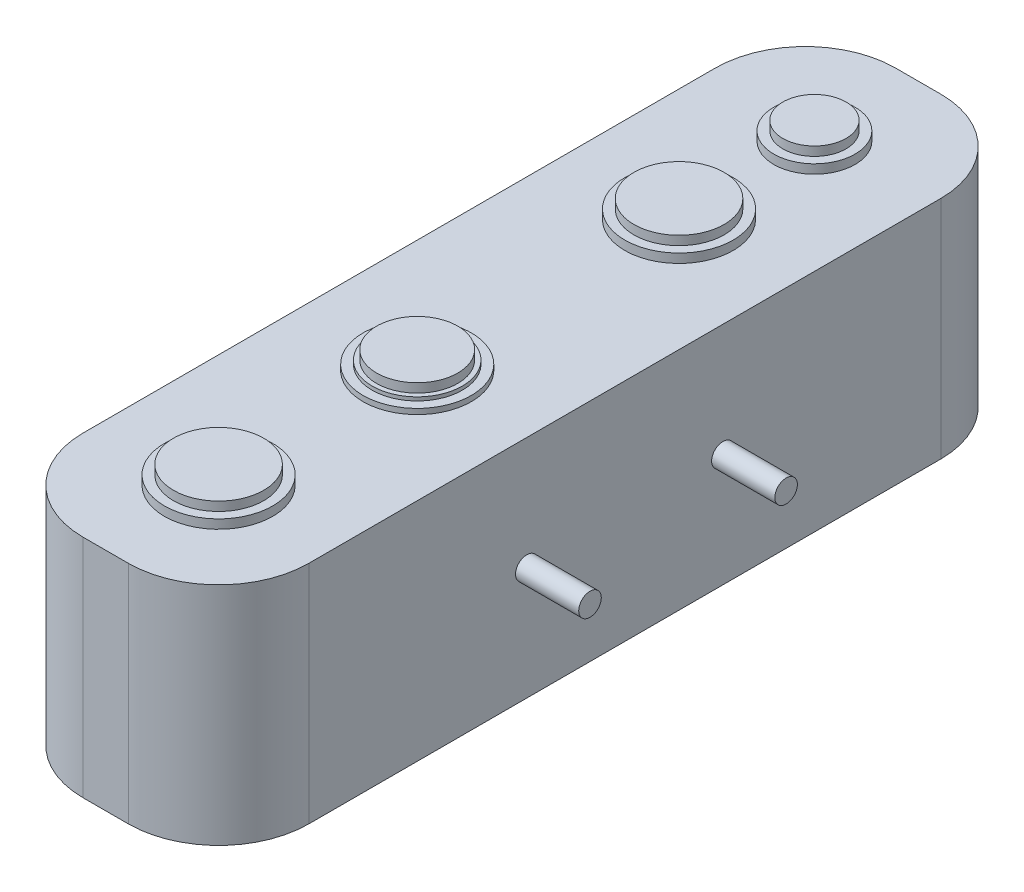
ISO-10303-21;
HEADER;
FILE_DESCRIPTION(('STEP AP214'),'2;1');
FILE_NAME('part.step','',(''),(''),'','','');
FILE_SCHEMA(('AUTOMOTIVE_DESIGN { 1 0 10303 214 1 1 1 1 }'));
ENDSEC;
DATA;
#1=APPLICATION_CONTEXT('core data for automotive mechanical design processes');
#2=APPLICATION_PROTOCOL_DEFINITION('international standard','automotive_design',2000,#1);
#3=PRODUCT_CONTEXT('',#1,'mechanical');
#4=PRODUCT('Part','Part','',(#3));
#5=PRODUCT_RELATED_PRODUCT_CATEGORY('part','',(#4));
#6=PRODUCT_DEFINITION_FORMATION('','',#4);
#7=PRODUCT_DEFINITION_CONTEXT('part definition',#1,'design');
#8=PRODUCT_DEFINITION('design','',#6,#7);
#9=PRODUCT_DEFINITION_SHAPE('','',#8);
#10=(LENGTH_UNIT() NAMED_UNIT(*) SI_UNIT(.MILLI.,.METRE.));
#11=(NAMED_UNIT(*) PLANE_ANGLE_UNIT() SI_UNIT($,.RADIAN.));
#12=(NAMED_UNIT(*) SI_UNIT($,.STERADIAN.) SOLID_ANGLE_UNIT());
#13=UNCERTAINTY_MEASURE_WITH_UNIT(LENGTH_MEASURE(1.E-05),#10,'distance_accuracy_value','');
#14=(GEOMETRIC_REPRESENTATION_CONTEXT(3) GLOBAL_UNCERTAINTY_ASSIGNED_CONTEXT((#13)) GLOBAL_UNIT_ASSIGNED_CONTEXT((#10,
#11,#12)) REPRESENTATION_CONTEXT('',''));
#15=CARTESIAN_POINT('',(0.,0.,0.));
#16=DIRECTION('',(0.,0.,1.));
#17=DIRECTION('',(1.,0.,0.));
#18=AXIS2_PLACEMENT_3D('',#15,#16,#17);
#19=CARTESIAN_POINT('',(12.5,25.,-45.));
#20=DIRECTION('',(-1.,0.,0.));
#21=DIRECTION('',(0.,0.,1.));
#22=AXIS2_PLACEMENT_3D('',#19,#20,#21);
#23=PLANE('',#22);
#24=CARTESIAN_POINT('',(12.5,12.5,10.86));
#25=DIRECTION('',(-1.,0.,0.));
#26=DIRECTION('',(0.,0.,1.));
#27=AXIS2_PLACEMENT_3D('',#24,#25,#26);
#28=CIRCLE('',#27,1.25);
#29=CARTESIAN_POINT('',(12.5,12.5,12.11));
#30=VERTEX_POINT('',#29);
#31=EDGE_CURVE('E11',#30,#30,#28,.F.);
#32=ORIENTED_EDGE('',*,*,#31,.F.);
#33=EDGE_LOOP('',(#32));
#34=FACE_BOUND('',#33,.T.);
#35=CARTESIAN_POINT('',(12.5,12.5,-10.86));
#36=DIRECTION('',(-1.,0.,0.));
#37=DIRECTION('',(0.,0.,1.));
#38=AXIS2_PLACEMENT_3D('',#35,#36,#37);
#39=CIRCLE('',#38,1.25);
#40=CARTESIAN_POINT('',(12.5,12.5,-9.61000000000002));
#41=VERTEX_POINT('',#40);
#42=EDGE_CURVE('E50',#41,#41,#39,.F.);
#43=ORIENTED_EDGE('',*,*,#42,.F.);
#44=EDGE_LOOP('',(#43));
#45=FACE_BOUND('',#44,.T.);
#46=DIRECTION('',(0.,0.,-1.));
#47=VECTOR('',#46,1.);
#48=CARTESIAN_POINT('',(12.5,25.,-45.));
#49=LINE('',#48,#47);
#50=CARTESIAN_POINT('',(12.5,25.,35.));
#51=VERTEX_POINT('',#50);
#52=CARTESIAN_POINT('',(12.5,25.,-35.));
#53=VERTEX_POINT('',#52);
#54=EDGE_CURVE('E138',#51,#53,#49,.T.);
#55=ORIENTED_EDGE('',*,*,#54,.F.);
#56=DIRECTION('',(0.,-1.,0.));
#57=VECTOR('',#56,1.);
#58=CARTESIAN_POINT('',(12.5,25.,35.));
#59=LINE('',#58,#57);
#60=CARTESIAN_POINT('',(12.5,0.,35.));
#61=VERTEX_POINT('',#60);
#62=EDGE_CURVE('E206',#51,#61,#59,.T.);
#63=ORIENTED_EDGE('',*,*,#62,.T.);
#64=DIRECTION('',(0.,0.,-1.));
#65=VECTOR('',#64,1.);
#66=CARTESIAN_POINT('',(12.5,0.,-45.));
#67=LINE('',#66,#65);
#68=CARTESIAN_POINT('',(12.5,0.,-35.));
#69=VERTEX_POINT('',#68);
#70=EDGE_CURVE('E242',#61,#69,#67,.T.);
#71=ORIENTED_EDGE('',*,*,#70,.T.);
#72=DIRECTION('',(0.,-1.,0.));
#73=VECTOR('',#72,1.);
#74=CARTESIAN_POINT('',(12.5,25.,-35.));
#75=LINE('',#74,#73);
#76=EDGE_CURVE('E203',#69,#53,#75,.F.);
#77=ORIENTED_EDGE('',*,*,#76,.T.);
#78=EDGE_LOOP('',(#55,#63,#71,#77));
#79=FACE_BOUND('',#78,.T.);
#80=ADVANCED_FACE('F41',(#34,#45,#79),#23,.F.);
#81=CARTESIAN_POINT('',(-12.5,25.,-45.));
#82=DIRECTION('',(0.,0.,1.));
#83=DIRECTION('',(1.,0.,0.));
#84=AXIS2_PLACEMENT_3D('',#81,#82,#83);
#85=PLANE('',#84);
#86=DIRECTION('',(-1.,0.,0.));
#87=VECTOR('',#86,1.);
#88=CARTESIAN_POINT('',(-12.5,25.,-45.));
#89=LINE('',#88,#87);
#90=CARTESIAN_POINT('',(2.5,25.,-45.));
#91=VERTEX_POINT('',#90);
#92=CARTESIAN_POINT('',(-2.5,25.,-45.));
#93=VERTEX_POINT('',#92);
#94=EDGE_CURVE('E143',#91,#93,#89,.T.);
#95=ORIENTED_EDGE('',*,*,#94,.F.);
#96=DIRECTION('',(0.,-1.,0.));
#97=VECTOR('',#96,1.);
#98=CARTESIAN_POINT('',(2.5,25.,-45.));
#99=LINE('',#98,#97);
#100=CARTESIAN_POINT('',(2.5,0.,-45.));
#101=VERTEX_POINT('',#100);
#102=EDGE_CURVE('E212',#91,#101,#99,.T.);
#103=ORIENTED_EDGE('',*,*,#102,.T.);
#104=DIRECTION('',(-1.,0.,0.));
#105=VECTOR('',#104,1.);
#106=CARTESIAN_POINT('',(-12.5,0.,-45.));
#107=LINE('',#106,#105);
#108=CARTESIAN_POINT('',(-2.5,0.,-45.));
#109=VERTEX_POINT('',#108);
#110=EDGE_CURVE('E145',#101,#109,#107,.T.);
#111=ORIENTED_EDGE('',*,*,#110,.T.);
#112=DIRECTION('',(0.,-1.,0.));
#113=VECTOR('',#112,1.);
#114=CARTESIAN_POINT('',(-2.5,25.,-45.));
#115=LINE('',#114,#113);
#116=EDGE_CURVE('E57',#109,#93,#115,.F.);
#117=ORIENTED_EDGE('',*,*,#116,.T.);
#118=EDGE_LOOP('',(#95,#103,#111,#117));
#119=FACE_BOUND('',#118,.T.);
#120=ADVANCED_FACE('F223',(#119),#85,.F.);
#121=CARTESIAN_POINT('',(-12.5,25.,-45.));
#122=DIRECTION('',(1.,0.,0.));
#123=DIRECTION('',(0.,0.,-1.));
#124=AXIS2_PLACEMENT_3D('',#121,#122,#123);
#125=PLANE('',#124);
#126=DIRECTION('',(0.,0.,1.));
#127=VECTOR('',#126,1.);
#128=CARTESIAN_POINT('',(-12.5,0.,-45.));
#129=LINE('',#128,#127);
#130=CARTESIAN_POINT('',(-12.5,0.,-35.));
#131=VERTEX_POINT('',#130);
#132=CARTESIAN_POINT('',(-12.5,0.,35.));
#133=VERTEX_POINT('',#132);
#134=EDGE_CURVE('E139',#131,#133,#129,.T.);
#135=ORIENTED_EDGE('',*,*,#134,.T.);
#136=DIRECTION('',(0.,-1.,0.));
#137=VECTOR('',#136,1.);
#138=CARTESIAN_POINT('',(-12.5,25.,35.));
#139=LINE('',#138,#137);
#140=CARTESIAN_POINT('',(-12.5,25.,35.));
#141=VERTEX_POINT('',#140);
#142=EDGE_CURVE('E114',#133,#141,#139,.F.);
#143=ORIENTED_EDGE('',*,*,#142,.T.);
#144=DIRECTION('',(0.,0.,1.));
#145=VECTOR('',#144,1.);
#146=CARTESIAN_POINT('',(-12.5,25.,-45.));
#147=LINE('',#146,#145);
#148=CARTESIAN_POINT('',(-12.5,25.,-35.));
#149=VERTEX_POINT('',#148);
#150=EDGE_CURVE('E236',#149,#141,#147,.T.);
#151=ORIENTED_EDGE('',*,*,#150,.F.);
#152=DIRECTION('',(0.,-1.,0.));
#153=VECTOR('',#152,1.);
#154=CARTESIAN_POINT('',(-12.5,25.,-35.));
#155=LINE('',#154,#153);
#156=EDGE_CURVE('E120',#149,#131,#155,.T.);
#157=ORIENTED_EDGE('',*,*,#156,.T.);
#158=EDGE_LOOP('',(#135,#143,#151,#157));
#159=FACE_BOUND('',#158,.T.);
#160=ADVANCED_FACE('F253',(#159),#125,.F.);
#161=CARTESIAN_POINT('',(-12.5,25.,45.));
#162=DIRECTION('',(0.,0.,-1.));
#163=DIRECTION('',(-1.,0.,0.));
#164=AXIS2_PLACEMENT_3D('',#161,#162,#163);
#165=PLANE('',#164);
#166=DIRECTION('',(1.,0.,0.));
#167=VECTOR('',#166,1.);
#168=CARTESIAN_POINT('',(-12.5,25.,45.));
#169=LINE('',#168,#167);
#170=CARTESIAN_POINT('',(-2.49999999999999,25.,45.));
#171=VERTEX_POINT('',#170);
#172=CARTESIAN_POINT('',(2.5,25.,45.));
#173=VERTEX_POINT('',#172);
#174=EDGE_CURVE('E130',#171,#173,#169,.T.);
#175=ORIENTED_EDGE('',*,*,#174,.F.);
#176=DIRECTION('',(0.,-1.,0.));
#177=VECTOR('',#176,1.);
#178=CARTESIAN_POINT('',(-2.49999999999999,25.,45.));
#179=LINE('',#178,#177);
#180=CARTESIAN_POINT('',(-2.49999999999999,0.,45.));
#181=VERTEX_POINT('',#180);
#182=EDGE_CURVE('E113',#171,#181,#179,.T.);
#183=ORIENTED_EDGE('',*,*,#182,.T.);
#184=DIRECTION('',(1.,0.,0.));
#185=VECTOR('',#184,1.);
#186=CARTESIAN_POINT('',(-12.5,0.,45.));
#187=LINE('',#186,#185);
#188=CARTESIAN_POINT('',(2.5,0.,45.));
#189=VERTEX_POINT('',#188);
#190=EDGE_CURVE('E127',#181,#189,#187,.T.);
#191=ORIENTED_EDGE('',*,*,#190,.T.);
#192=DIRECTION('',(0.,-1.,0.));
#193=VECTOR('',#192,1.);
#194=CARTESIAN_POINT('',(2.5,25.,45.));
#195=LINE('',#194,#193);
#196=EDGE_CURVE('E133',#189,#173,#195,.F.);
#197=ORIENTED_EDGE('',*,*,#196,.T.);
#198=EDGE_LOOP('',(#175,#183,#191,#197));
#199=FACE_BOUND('',#198,.T.);
#200=ADVANCED_FACE('F126',(#199),#165,.F.);
#201=CARTESIAN_POINT('',(0.,25.,0.));
#202=DIRECTION('',(0.,1.,0.));
#203=DIRECTION('',(0.,0.,1.));
#204=AXIS2_PLACEMENT_3D('',#201,#202,#203);
#205=PLANE('',#204);
#206=CARTESIAN_POINT('',(0.,25.,10.5));
#207=DIRECTION('',(0.,1.,0.));
#208=DIRECTION('',(0.,0.,1.));
#209=AXIS2_PLACEMENT_3D('',#206,#207,#208);
#210=CIRCLE('',#209,6.);
#211=CARTESIAN_POINT('',(0.,25.,16.5));
#212=VERTEX_POINT('',#211);
#213=EDGE_CURVE('E505',#212,#212,#210,.T.);
#214=ORIENTED_EDGE('',*,*,#213,.F.);
#215=EDGE_LOOP('',(#214));
#216=FACE_BOUND('',#215,.T.);
#217=CARTESIAN_POINT('',(0.,25.,-33.5));
#218=DIRECTION('',(0.,1.,0.));
#219=DIRECTION('',(0.,0.,1.));
#220=AXIS2_PLACEMENT_3D('',#217,#218,#219);
#221=CIRCLE('',#220,4.5);
#222=CARTESIAN_POINT('',(0.,25.,-29.));
#223=VERTEX_POINT('',#222);
#224=EDGE_CURVE('E171',#223,#223,#221,.T.);
#225=ORIENTED_EDGE('',*,*,#224,.F.);
#226=EDGE_LOOP('',(#225));
#227=FACE_BOUND('',#226,.T.);
#228=CARTESIAN_POINT('',(0.,25.,-18.5));
#229=DIRECTION('',(0.,1.,0.));
#230=DIRECTION('',(0.,0.,1.));
#231=AXIS2_PLACEMENT_3D('',#228,#229,#230);
#232=CIRCLE('',#231,6.);
#233=CARTESIAN_POINT('',(0.,25.,-12.5));
#234=VERTEX_POINT('',#233);
#235=EDGE_CURVE('E160',#234,#234,#232,.T.);
#236=ORIENTED_EDGE('',*,*,#235,.F.);
#237=EDGE_LOOP('',(#236));
#238=FACE_BOUND('',#237,.T.);
#239=CARTESIAN_POINT('',(0.,25.,32.5));
#240=DIRECTION('',(0.,1.,0.));
#241=DIRECTION('',(0.,0.,1.));
#242=AXIS2_PLACEMENT_3D('',#239,#240,#241);
#243=CIRCLE('',#242,6.);
#244=CARTESIAN_POINT('',(0.,25.,38.5));
#245=VERTEX_POINT('',#244);
#246=EDGE_CURVE('E159',#245,#245,#243,.T.);
#247=ORIENTED_EDGE('',*,*,#246,.F.);
#248=EDGE_LOOP('',(#247));
#249=FACE_BOUND('',#248,.T.);
#250=ORIENTED_EDGE('',*,*,#150,.T.);
#251=CARTESIAN_POINT('',(-2.49999999999999,25.,35.));
#252=DIRECTION('',(0.,1.,0.));
#253=DIRECTION('',(0.,0.,1.));
#254=AXIS2_PLACEMENT_3D('',#251,#252,#253);
#255=CIRCLE('',#254,10.);
#256=EDGE_CURVE('E200',#141,#171,#255,.T.);
#257=ORIENTED_EDGE('',*,*,#256,.T.);
#258=ORIENTED_EDGE('',*,*,#174,.T.);
#259=CARTESIAN_POINT('',(2.5,25.,35.));
#260=DIRECTION('',(0.,1.,0.));
#261=DIRECTION('',(0.,0.,1.));
#262=AXIS2_PLACEMENT_3D('',#259,#260,#261);
#263=CIRCLE('',#262,10.);
#264=EDGE_CURVE('E197',#173,#51,#263,.T.);
#265=ORIENTED_EDGE('',*,*,#264,.T.);
#266=ORIENTED_EDGE('',*,*,#54,.T.);
#267=CARTESIAN_POINT('',(2.5,25.,-35.));
#268=DIRECTION('',(0.,1.,0.));
#269=DIRECTION('',(0.,0.,1.));
#270=AXIS2_PLACEMENT_3D('',#267,#268,#269);
#271=CIRCLE('',#270,10.);
#272=EDGE_CURVE('E64',#53,#91,#271,.T.);
#273=ORIENTED_EDGE('',*,*,#272,.T.);
#274=ORIENTED_EDGE('',*,*,#94,.T.);
#275=CARTESIAN_POINT('',(-2.5,25.,-35.));
#276=DIRECTION('',(0.,1.,0.));
#277=DIRECTION('',(0.,0.,1.));
#278=AXIS2_PLACEMENT_3D('',#275,#276,#277);
#279=CIRCLE('',#278,10.);
#280=EDGE_CURVE('E192',#93,#149,#279,.T.);
#281=ORIENTED_EDGE('',*,*,#280,.T.);
#282=EDGE_LOOP('',(#250,#257,#258,#265,#266,#273,#274,#281));
#283=FACE_BOUND('',#282,.T.);
#284=ADVANCED_FACE('F234',(#216,#227,#238,#249,#283),#205,.T.);
#285=CARTESIAN_POINT('',(0.,0.,0.));
#286=DIRECTION('',(0.,1.,0.));
#287=DIRECTION('',(0.,0.,1.));
#288=AXIS2_PLACEMENT_3D('',#285,#286,#287);
#289=PLANE('',#288);
#290=ORIENTED_EDGE('',*,*,#190,.F.);
#291=CARTESIAN_POINT('',(-2.49999999999999,0.,35.));
#292=DIRECTION('',(0.,1.,0.));
#293=DIRECTION('',(0.,0.,1.));
#294=AXIS2_PLACEMENT_3D('',#291,#292,#293);
#295=CIRCLE('',#294,10.);
#296=EDGE_CURVE('E109',#181,#133,#295,.F.);
#297=ORIENTED_EDGE('',*,*,#296,.T.);
#298=ORIENTED_EDGE('',*,*,#134,.F.);
#299=CARTESIAN_POINT('',(-2.5,0.,-35.));
#300=DIRECTION('',(0.,1.,0.));
#301=DIRECTION('',(0.,0.,1.));
#302=AXIS2_PLACEMENT_3D('',#299,#300,#301);
#303=CIRCLE('',#302,10.);
#304=EDGE_CURVE('E132',#131,#109,#303,.F.);
#305=ORIENTED_EDGE('',*,*,#304,.T.);
#306=ORIENTED_EDGE('',*,*,#110,.F.);
#307=CARTESIAN_POINT('',(2.5,0.,-35.));
#308=DIRECTION('',(0.,1.,0.));
#309=DIRECTION('',(0.,0.,1.));
#310=AXIS2_PLACEMENT_3D('',#307,#308,#309);
#311=CIRCLE('',#310,10.);
#312=EDGE_CURVE('E182',#101,#69,#311,.F.);
#313=ORIENTED_EDGE('',*,*,#312,.T.);
#314=ORIENTED_EDGE('',*,*,#70,.F.);
#315=CARTESIAN_POINT('',(2.5,0.,35.));
#316=DIRECTION('',(0.,1.,0.));
#317=DIRECTION('',(0.,0.,1.));
#318=AXIS2_PLACEMENT_3D('',#315,#316,#317);
#319=CIRCLE('',#318,10.);
#320=EDGE_CURVE('E121',#61,#189,#319,.F.);
#321=ORIENTED_EDGE('',*,*,#320,.T.);
#322=EDGE_LOOP('',(#290,#297,#298,#305,#306,#313,#314,#321));
#323=FACE_BOUND('',#322,.T.);
#324=ADVANCED_FACE('F135',(#323),#289,.F.);
#325=CARTESIAN_POINT('',(0.,26.,32.5));
#326=DIRECTION('',(0.,-1.,0.));
#327=DIRECTION('',(0.,0.,-1.));
#328=AXIS2_PLACEMENT_3D('',#325,#326,#327);
#329=CYLINDRICAL_SURFACE('',#328,6.);
#330=CARTESIAN_POINT('',(0.,26.,32.5));
#331=DIRECTION('',(0.,1.,0.));
#332=DIRECTION('',(0.,0.,1.));
#333=AXIS2_PLACEMENT_3D('',#330,#331,#332);
#334=CIRCLE('',#333,6.);
#335=CARTESIAN_POINT('',(0.,26.,38.5));
#336=VERTEX_POINT('',#335);
#337=EDGE_CURVE('E154',#336,#336,#334,.T.);
#338=ORIENTED_EDGE('',*,*,#337,.F.);
#339=EDGE_LOOP('',(#338));
#340=FACE_BOUND('',#339,.T.);
#341=ORIENTED_EDGE('',*,*,#246,.T.);
#342=EDGE_LOOP('',(#341));
#343=FACE_BOUND('',#342,.T.);
#344=ADVANCED_FACE('F331',(#340,#343),#329,.T.);
#345=CARTESIAN_POINT('',(0.,26.,32.5));
#346=DIRECTION('',(0.,1.,0.));
#347=DIRECTION('',(0.,0.,1.));
#348=AXIS2_PLACEMENT_3D('',#345,#346,#347);
#349=PLANE('',#348);
#350=CARTESIAN_POINT('',(0.,26.,32.5));
#351=DIRECTION('',(0.,1.,0.));
#352=DIRECTION('',(0.,0.,1.));
#353=AXIS2_PLACEMENT_3D('',#350,#351,#352);
#354=CIRCLE('',#353,5.);
#355=CARTESIAN_POINT('',(0.,26.,37.5));
#356=VERTEX_POINT('',#355);
#357=EDGE_CURVE('E149',#356,#356,#354,.T.);
#358=ORIENTED_EDGE('',*,*,#357,.F.);
#359=EDGE_LOOP('',(#358));
#360=FACE_BOUND('',#359,.T.);
#361=ORIENTED_EDGE('',*,*,#337,.T.);
#362=EDGE_LOOP('',(#361));
#363=FACE_BOUND('',#362,.T.);
#364=ADVANCED_FACE('F327',(#360,#363),#349,.T.);
#365=CARTESIAN_POINT('',(0.,27.,32.5));
#366=DIRECTION('',(0.,1.,0.));
#367=DIRECTION('',(0.,0.,1.));
#368=AXIS2_PLACEMENT_3D('',#365,#366,#367);
#369=PLANE('',#368);
#370=CARTESIAN_POINT('',(0.,27.,32.5));
#371=DIRECTION('',(0.,1.,0.));
#372=DIRECTION('',(0.,0.,1.));
#373=AXIS2_PLACEMENT_3D('',#370,#371,#372);
#374=CIRCLE('',#373,5.);
#375=CARTESIAN_POINT('',(0.,27.,37.5));
#376=VERTEX_POINT('',#375);
#377=EDGE_CURVE('E244',#376,#376,#374,.T.);
#378=ORIENTED_EDGE('',*,*,#377,.T.);
#379=EDGE_LOOP('',(#378));
#380=FACE_BOUND('',#379,.T.);
#381=ADVANCED_FACE('F330',(#380),#369,.T.);
#382=CARTESIAN_POINT('',(0.,27.,32.5));
#383=DIRECTION('',(0.,-1.,0.));
#384=DIRECTION('',(0.,0.,-1.));
#385=AXIS2_PLACEMENT_3D('',#382,#383,#384);
#386=CYLINDRICAL_SURFACE('',#385,5.);
#387=ORIENTED_EDGE('',*,*,#357,.T.);
#388=EDGE_LOOP('',(#387));
#389=FACE_BOUND('',#388,.T.);
#390=ORIENTED_EDGE('',*,*,#377,.F.);
#391=EDGE_LOOP('',(#390));
#392=FACE_BOUND('',#391,.T.);
#393=ADVANCED_FACE('F321',(#389,#392),#386,.T.);
#394=CARTESIAN_POINT('',(0.,26.,-18.5));
#395=DIRECTION('',(0.,-1.,0.));
#396=DIRECTION('',(0.,0.,-1.));
#397=AXIS2_PLACEMENT_3D('',#394,#395,#396);
#398=CYLINDRICAL_SURFACE('',#397,6.);
#399=CARTESIAN_POINT('',(0.,26.,-18.5));
#400=DIRECTION('',(0.,1.,0.));
#401=DIRECTION('',(0.,0.,1.));
#402=AXIS2_PLACEMENT_3D('',#399,#400,#401);
#403=CIRCLE('',#402,6.);
#404=CARTESIAN_POINT('',(0.,26.,-12.5));
#405=VERTEX_POINT('',#404);
#406=EDGE_CURVE('E165',#405,#405,#403,.T.);
#407=ORIENTED_EDGE('',*,*,#406,.F.);
#408=EDGE_LOOP('',(#407));
#409=FACE_BOUND('',#408,.T.);
#410=ORIENTED_EDGE('',*,*,#235,.T.);
#411=EDGE_LOOP('',(#410));
#412=FACE_BOUND('',#411,.T.);
#413=ADVANCED_FACE('F317',(#409,#412),#398,.T.);
#414=CARTESIAN_POINT('',(0.,26.,-18.5));
#415=DIRECTION('',(0.,1.,0.));
#416=DIRECTION('',(0.,0.,1.));
#417=AXIS2_PLACEMENT_3D('',#414,#415,#416);
#418=PLANE('',#417);
#419=CARTESIAN_POINT('',(0.,26.,-18.5));
#420=DIRECTION('',(0.,1.,0.));
#421=DIRECTION('',(0.,0.,1.));
#422=AXIS2_PLACEMENT_3D('',#419,#420,#421);
#423=CIRCLE('',#422,5.);
#424=CARTESIAN_POINT('',(0.,26.,-13.5));
#425=VERTEX_POINT('',#424);
#426=EDGE_CURVE('E155',#425,#425,#423,.T.);
#427=ORIENTED_EDGE('',*,*,#426,.F.);
#428=EDGE_LOOP('',(#427));
#429=FACE_BOUND('',#428,.T.);
#430=ORIENTED_EDGE('',*,*,#406,.T.);
#431=EDGE_LOOP('',(#430));
#432=FACE_BOUND('',#431,.T.);
#433=ADVANCED_FACE('F320',(#429,#432),#418,.T.);
#434=CARTESIAN_POINT('',(0.,27.,-18.5));
#435=DIRECTION('',(0.,1.,0.));
#436=DIRECTION('',(0.,0.,1.));
#437=AXIS2_PLACEMENT_3D('',#434,#435,#436);
#438=PLANE('',#437);
#439=CARTESIAN_POINT('',(0.,27.,-18.5));
#440=DIRECTION('',(0.,1.,0.));
#441=DIRECTION('',(0.,0.,1.));
#442=AXIS2_PLACEMENT_3D('',#439,#440,#441);
#443=CIRCLE('',#442,5.);
#444=CARTESIAN_POINT('',(0.,27.,-13.5));
#445=VERTEX_POINT('',#444);
#446=EDGE_CURVE('E538',#445,#445,#443,.T.);
#447=ORIENTED_EDGE('',*,*,#446,.T.);
#448=EDGE_LOOP('',(#447));
#449=FACE_BOUND('',#448,.T.);
#450=ADVANCED_FACE('F325',(#449),#438,.T.);
#451=CARTESIAN_POINT('',(0.,27.,-18.5));
#452=DIRECTION('',(0.,-1.,0.));
#453=DIRECTION('',(0.,0.,-1.));
#454=AXIS2_PLACEMENT_3D('',#451,#452,#453);
#455=CYLINDRICAL_SURFACE('',#454,5.);
#456=ORIENTED_EDGE('',*,*,#426,.T.);
#457=EDGE_LOOP('',(#456));
#458=FACE_BOUND('',#457,.T.);
#459=ORIENTED_EDGE('',*,*,#446,.F.);
#460=EDGE_LOOP('',(#459));
#461=FACE_BOUND('',#460,.T.);
#462=ADVANCED_FACE('F303',(#458,#461),#455,.T.);
#463=CARTESIAN_POINT('',(0.,26.,-33.5));
#464=DIRECTION('',(0.,-1.,0.));
#465=DIRECTION('',(0.,0.,-1.));
#466=AXIS2_PLACEMENT_3D('',#463,#464,#465);
#467=CYLINDRICAL_SURFACE('',#466,4.5);
#468=CARTESIAN_POINT('',(0.,26.,-33.5));
#469=DIRECTION('',(0.,1.,0.));
#470=DIRECTION('',(0.,0.,1.));
#471=AXIS2_PLACEMENT_3D('',#468,#469,#470);
#472=CIRCLE('',#471,4.5);
#473=CARTESIAN_POINT('',(0.,26.,-29.));
#474=VERTEX_POINT('',#473);
#475=EDGE_CURVE('E176',#474,#474,#472,.T.);
#476=ORIENTED_EDGE('',*,*,#475,.F.);
#477=EDGE_LOOP('',(#476));
#478=FACE_BOUND('',#477,.T.);
#479=ORIENTED_EDGE('',*,*,#224,.T.);
#480=EDGE_LOOP('',(#479));
#481=FACE_BOUND('',#480,.T.);
#482=ADVANCED_FACE('F299',(#478,#481),#467,.T.);
#483=CARTESIAN_POINT('',(0.,26.,-33.5));
#484=DIRECTION('',(0.,1.,0.));
#485=DIRECTION('',(0.,0.,1.));
#486=AXIS2_PLACEMENT_3D('',#483,#484,#485);
#487=PLANE('',#486);
#488=CARTESIAN_POINT('',(0.,26.,-33.5));
#489=DIRECTION('',(0.,1.,0.));
#490=DIRECTION('',(0.,0.,1.));
#491=AXIS2_PLACEMENT_3D('',#488,#489,#490);
#492=CIRCLE('',#491,3.5);
#493=CARTESIAN_POINT('',(0.,26.,-30.));
#494=VERTEX_POINT('',#493);
#495=EDGE_CURVE('E167',#494,#494,#492,.T.);
#496=ORIENTED_EDGE('',*,*,#495,.F.);
#497=EDGE_LOOP('',(#496));
#498=FACE_BOUND('',#497,.T.);
#499=ORIENTED_EDGE('',*,*,#475,.T.);
#500=EDGE_LOOP('',(#499));
#501=FACE_BOUND('',#500,.T.);
#502=ADVANCED_FACE('F302',(#498,#501),#487,.T.);
#503=CARTESIAN_POINT('',(0.,27.,-33.5));
#504=DIRECTION('',(0.,1.,0.));
#505=DIRECTION('',(0.,0.,1.));
#506=AXIS2_PLACEMENT_3D('',#503,#504,#505);
#507=PLANE('',#506);
#508=CARTESIAN_POINT('',(0.,27.,-33.5));
#509=DIRECTION('',(0.,1.,0.));
#510=DIRECTION('',(0.,0.,1.));
#511=AXIS2_PLACEMENT_3D('',#508,#509,#510);
#512=CIRCLE('',#511,3.5);
#513=CARTESIAN_POINT('',(0.,27.,-30.));
#514=VERTEX_POINT('',#513);
#515=EDGE_CURVE('E153',#514,#514,#512,.T.);
#516=ORIENTED_EDGE('',*,*,#515,.T.);
#517=EDGE_LOOP('',(#516));
#518=FACE_BOUND('',#517,.T.);
#519=ADVANCED_FACE('F307',(#518),#507,.T.);
#520=CARTESIAN_POINT('',(0.,27.,-33.5));
#521=DIRECTION('',(0.,-1.,0.));
#522=DIRECTION('',(0.,0.,-1.));
#523=AXIS2_PLACEMENT_3D('',#520,#521,#522);
#524=CYLINDRICAL_SURFACE('',#523,3.5);
#525=ORIENTED_EDGE('',*,*,#495,.T.);
#526=EDGE_LOOP('',(#525));
#527=FACE_BOUND('',#526,.T.);
#528=ORIENTED_EDGE('',*,*,#515,.F.);
#529=EDGE_LOOP('',(#528));
#530=FACE_BOUND('',#529,.T.);
#531=ADVANCED_FACE('F297',(#527,#530),#524,.T.);
#532=CARTESIAN_POINT('',(0.,25.6,10.5));
#533=DIRECTION('',(0.,-1.,0.));
#534=DIRECTION('',(0.,0.,-1.));
#535=AXIS2_PLACEMENT_3D('',#532,#533,#534);
#536=CYLINDRICAL_SURFACE('',#535,6.);
#537=CARTESIAN_POINT('',(0.,25.6,10.5));
#538=DIRECTION('',(0.,1.,0.));
#539=DIRECTION('',(0.,0.,1.));
#540=AXIS2_PLACEMENT_3D('',#537,#538,#539);
#541=CIRCLE('',#540,6.);
#542=CARTESIAN_POINT('',(0.,25.6,16.5));
#543=VERTEX_POINT('',#542);
#544=EDGE_CURVE('E177',#543,#543,#541,.T.);
#545=ORIENTED_EDGE('',*,*,#544,.F.);
#546=EDGE_LOOP('',(#545));
#547=FACE_BOUND('',#546,.T.);
#548=ORIENTED_EDGE('',*,*,#213,.T.);
#549=EDGE_LOOP('',(#548));
#550=FACE_BOUND('',#549,.T.);
#551=ADVANCED_FACE('F293',(#547,#550),#536,.T.);
#552=CARTESIAN_POINT('',(0.,25.6,10.5));
#553=DIRECTION('',(0.,1.,0.));
#554=DIRECTION('',(0.,0.,1.));
#555=AXIS2_PLACEMENT_3D('',#552,#553,#554);
#556=PLANE('',#555);
#557=CARTESIAN_POINT('',(0.,25.6,10.5));
#558=DIRECTION('',(0.,1.,0.));
#559=DIRECTION('',(0.,0.,1.));
#560=AXIS2_PLACEMENT_3D('',#557,#558,#559);
#561=CIRCLE('',#560,5.);
#562=CARTESIAN_POINT('',(0.,25.6,15.5));
#563=VERTEX_POINT('',#562);
#564=EDGE_CURVE('E172',#563,#563,#561,.T.);
#565=ORIENTED_EDGE('',*,*,#564,.F.);
#566=EDGE_LOOP('',(#565));
#567=FACE_BOUND('',#566,.T.);
#568=ORIENTED_EDGE('',*,*,#544,.T.);
#569=EDGE_LOOP('',(#568));
#570=FACE_BOUND('',#569,.T.);
#571=ADVANCED_FACE('F289',(#567,#570),#556,.T.);
#572=CARTESIAN_POINT('',(0.,27.,10.5));
#573=DIRECTION('',(0.,1.,0.));
#574=DIRECTION('',(0.,0.,1.));
#575=AXIS2_PLACEMENT_3D('',#572,#573,#574);
#576=PLANE('',#575);
#577=CARTESIAN_POINT('',(0.,27.,10.5));
#578=DIRECTION('',(0.,1.,0.));
#579=DIRECTION('',(0.,0.,1.));
#580=AXIS2_PLACEMENT_3D('',#577,#578,#579);
#581=CIRCLE('',#580,4.5);
#582=CARTESIAN_POINT('',(0.,27.,15.));
#583=VERTEX_POINT('',#582);
#584=EDGE_CURVE('E542',#583,#583,#581,.T.);
#585=ORIENTED_EDGE('',*,*,#584,.T.);
#586=EDGE_LOOP('',(#585));
#587=FACE_BOUND('',#586,.T.);
#588=ADVANCED_FACE('F292',(#587),#576,.T.);
#589=CARTESIAN_POINT('',(0.,27.,10.5));
#590=DIRECTION('',(0.,-1.,0.));
#591=DIRECTION('',(0.,0.,-1.));
#592=AXIS2_PLACEMENT_3D('',#589,#590,#591);
#593=CYLINDRICAL_SURFACE('',#592,4.5);
#594=CARTESIAN_POINT('',(0.,26.,10.5));
#595=DIRECTION('',(0.,1.,0.));
#596=DIRECTION('',(0.,0.,1.));
#597=AXIS2_PLACEMENT_3D('',#594,#595,#596);
#598=CIRCLE('',#597,4.5);
#599=CARTESIAN_POINT('',(0.,26.,15.));
#600=VERTEX_POINT('',#599);
#601=EDGE_CURVE('E161',#600,#600,#598,.T.);
#602=ORIENTED_EDGE('',*,*,#601,.T.);
#603=EDGE_LOOP('',(#602));
#604=FACE_BOUND('',#603,.T.);
#605=ORIENTED_EDGE('',*,*,#584,.F.);
#606=EDGE_LOOP('',(#605));
#607=FACE_BOUND('',#606,.T.);
#608=ADVANCED_FACE('F315',(#604,#607),#593,.T.);
#609=CARTESIAN_POINT('',(0.,26.,10.5));
#610=DIRECTION('',(0.,1.,0.));
#611=DIRECTION('',(0.,0.,1.));
#612=AXIS2_PLACEMENT_3D('',#609,#610,#611);
#613=PLANE('',#612);
#614=ORIENTED_EDGE('',*,*,#601,.F.);
#615=EDGE_LOOP('',(#614));
#616=FACE_BOUND('',#615,.T.);
#617=CARTESIAN_POINT('',(0.,26.,10.5));
#618=DIRECTION('',(0.,1.,0.));
#619=DIRECTION('',(0.,0.,1.));
#620=AXIS2_PLACEMENT_3D('',#617,#618,#619);
#621=CIRCLE('',#620,5.);
#622=CARTESIAN_POINT('',(0.,26.,15.5));
#623=VERTEX_POINT('',#622);
#624=EDGE_CURVE('E166',#623,#623,#621,.T.);
#625=ORIENTED_EDGE('',*,*,#624,.T.);
#626=EDGE_LOOP('',(#625));
#627=FACE_BOUND('',#626,.T.);
#628=ADVANCED_FACE('F311',(#616,#627),#613,.T.);
#629=CARTESIAN_POINT('',(0.,26.,10.5));
#630=DIRECTION('',(0.,-1.,0.));
#631=DIRECTION('',(0.,0.,-1.));
#632=AXIS2_PLACEMENT_3D('',#629,#630,#631);
#633=CYLINDRICAL_SURFACE('',#632,5.);
#634=ORIENTED_EDGE('',*,*,#564,.T.);
#635=EDGE_LOOP('',(#634));
#636=FACE_BOUND('',#635,.T.);
#637=ORIENTED_EDGE('',*,*,#624,.F.);
#638=EDGE_LOOP('',(#637));
#639=FACE_BOUND('',#638,.T.);
#640=ADVANCED_FACE('F266',(#636,#639),#633,.T.);
#641=CARTESIAN_POINT('',(-2.49999999999999,25.,35.));
#642=DIRECTION('',(0.,-1.,0.));
#643=DIRECTION('',(0.,0.,-1.));
#644=AXIS2_PLACEMENT_3D('',#641,#642,#643);
#645=CYLINDRICAL_SURFACE('',#644,10.);
#646=ORIENTED_EDGE('',*,*,#256,.F.);
#647=ORIENTED_EDGE('',*,*,#142,.F.);
#648=ORIENTED_EDGE('',*,*,#296,.F.);
#649=ORIENTED_EDGE('',*,*,#182,.F.);
#650=EDGE_LOOP('',(#646,#647,#648,#649));
#651=FACE_BOUND('',#650,.T.);
#652=ADVANCED_FACE('F112',(#651),#645,.T.);
#653=CARTESIAN_POINT('',(2.5,25.,35.));
#654=DIRECTION('',(0.,-1.,0.));
#655=DIRECTION('',(0.,0.,-1.));
#656=AXIS2_PLACEMENT_3D('',#653,#654,#655);
#657=CYLINDRICAL_SURFACE('',#656,10.);
#658=ORIENTED_EDGE('',*,*,#264,.F.);
#659=ORIENTED_EDGE('',*,*,#196,.F.);
#660=ORIENTED_EDGE('',*,*,#320,.F.);
#661=ORIENTED_EDGE('',*,*,#62,.F.);
#662=EDGE_LOOP('',(#658,#659,#660,#661));
#663=FACE_BOUND('',#662,.T.);
#664=ADVANCED_FACE('F232',(#663),#657,.T.);
#665=CARTESIAN_POINT('',(2.5,25.,-35.));
#666=DIRECTION('',(0.,-1.,0.));
#667=DIRECTION('',(0.,0.,-1.));
#668=AXIS2_PLACEMENT_3D('',#665,#666,#667);
#669=CYLINDRICAL_SURFACE('',#668,10.);
#670=ORIENTED_EDGE('',*,*,#272,.F.);
#671=ORIENTED_EDGE('',*,*,#76,.F.);
#672=ORIENTED_EDGE('',*,*,#312,.F.);
#673=ORIENTED_EDGE('',*,*,#102,.F.);
#674=EDGE_LOOP('',(#670,#671,#672,#673));
#675=FACE_BOUND('',#674,.T.);
#676=ADVANCED_FACE('F268',(#675),#669,.T.);
#677=CARTESIAN_POINT('',(-2.5,25.,-35.));
#678=DIRECTION('',(0.,-1.,0.));
#679=DIRECTION('',(0.,0.,-1.));
#680=AXIS2_PLACEMENT_3D('',#677,#678,#679);
#681=CYLINDRICAL_SURFACE('',#680,10.);
#682=ORIENTED_EDGE('',*,*,#280,.F.);
#683=ORIENTED_EDGE('',*,*,#116,.F.);
#684=ORIENTED_EDGE('',*,*,#304,.F.);
#685=ORIENTED_EDGE('',*,*,#156,.F.);
#686=EDGE_LOOP('',(#682,#683,#684,#685));
#687=FACE_BOUND('',#686,.T.);
#688=ADVANCED_FACE('F43',(#687),#681,.T.);
#689=CARTESIAN_POINT('',(19.5,12.5,-10.86));
#690=DIRECTION('',(-1.,0.,0.));
#691=DIRECTION('',(0.,0.,1.));
#692=AXIS2_PLACEMENT_3D('',#689,#690,#691);
#693=CYLINDRICAL_SURFACE('',#692,1.25);
#694=CARTESIAN_POINT('',(19.5,12.5,-10.86));
#695=DIRECTION('',(1.,0.,0.));
#696=DIRECTION('',(0.,0.,-1.));
#697=AXIS2_PLACEMENT_3D('',#694,#695,#696);
#698=CIRCLE('',#697,1.25);
#699=CARTESIAN_POINT('',(19.5,12.5,-12.11));
#700=VERTEX_POINT('',#699);
#701=EDGE_CURVE('E501',#700,#700,#698,.T.);
#702=ORIENTED_EDGE('',*,*,#701,.F.);
#703=EDGE_LOOP('',(#702));
#704=FACE_BOUND('',#703,.T.);
#705=ORIENTED_EDGE('',*,*,#42,.T.);
#706=EDGE_LOOP('',(#705));
#707=FACE_BOUND('',#706,.T.);
#708=ADVANCED_FACE('F219',(#704,#707),#693,.T.);
#709=CARTESIAN_POINT('',(19.5,12.5,-10.86));
#710=DIRECTION('',(1.,0.,0.));
#711=DIRECTION('',(0.,0.,-1.));
#712=AXIS2_PLACEMENT_3D('',#709,#710,#711);
#713=PLANE('',#712);
#714=ORIENTED_EDGE('',*,*,#701,.T.);
#715=EDGE_LOOP('',(#714));
#716=FACE_BOUND('',#715,.T.);
#717=ADVANCED_FACE('F277',(#716),#713,.T.);
#718=CARTESIAN_POINT('',(19.5,12.5,10.86));
#719=DIRECTION('',(-1.,0.,0.));
#720=DIRECTION('',(0.,0.,1.));
#721=AXIS2_PLACEMENT_3D('',#718,#719,#720);
#722=CYLINDRICAL_SURFACE('',#721,1.25);
#723=CARTESIAN_POINT('',(19.5,12.5,10.86));
#724=DIRECTION('',(1.,0.,0.));
#725=DIRECTION('',(0.,0.,-1.));
#726=AXIS2_PLACEMENT_3D('',#723,#724,#725);
#727=CIRCLE('',#726,1.25);
#728=CARTESIAN_POINT('',(19.5,12.5,9.60999999999998));
#729=VERTEX_POINT('',#728);
#730=EDGE_CURVE('E499',#729,#729,#727,.T.);
#731=ORIENTED_EDGE('',*,*,#730,.F.);
#732=EDGE_LOOP('',(#731));
#733=FACE_BOUND('',#732,.T.);
#734=ORIENTED_EDGE('',*,*,#31,.T.);
#735=EDGE_LOOP('',(#734));
#736=FACE_BOUND('',#735,.T.);
#737=ADVANCED_FACE('F283',(#733,#736),#722,.T.);
#738=CARTESIAN_POINT('',(19.5,12.5,10.86));
#739=DIRECTION('',(1.,0.,0.));
#740=DIRECTION('',(0.,0.,-1.));
#741=AXIS2_PLACEMENT_3D('',#738,#739,#740);
#742=PLANE('',#741);
#743=ORIENTED_EDGE('',*,*,#730,.T.);
#744=EDGE_LOOP('',(#743));
#745=FACE_BOUND('',#744,.T.);
#746=ADVANCED_FACE('F484',(#745),#742,.T.);
#747=CLOSED_SHELL('',(#80,#120,#160,#200,#284,#324,#344,#364,#381,#393,#413,#433,#450,#462,#482,
#502,#519,#531,#551,#571,#588,#608,#628,#640,#652,#664,#676,#688,#708,#717,#737,#746));
#748=MANIFOLD_SOLID_BREP('B2',#747);
#749=ADVANCED_BREP_SHAPE_REPRESENTATION('',(#18,#748),#14);
#750=SHAPE_DEFINITION_REPRESENTATION(#9,#749);
ENDSEC;
END-ISO-10303-21;
